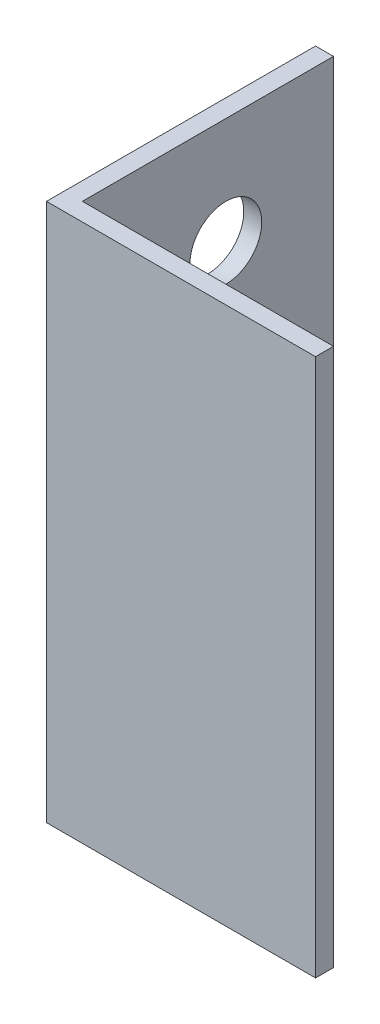
ISO-10303-21;
HEADER;
FILE_DESCRIPTION(('STEP AP214'),'2;1');
FILE_NAME('part.step','',(''),(''),'','','');
FILE_SCHEMA(('AUTOMOTIVE_DESIGN { 1 0 10303 214 1 1 1 1 }'));
ENDSEC;
DATA;
#1=APPLICATION_CONTEXT('core data for automotive mechanical design processes');
#2=APPLICATION_PROTOCOL_DEFINITION('international standard','automotive_design',2000,#1);
#3=PRODUCT_CONTEXT('',#1,'mechanical');
#4=PRODUCT('Part','Part','',(#3));
#5=PRODUCT_RELATED_PRODUCT_CATEGORY('part','',(#4));
#6=PRODUCT_DEFINITION_FORMATION('','',#4);
#7=PRODUCT_DEFINITION_CONTEXT('part definition',#1,'design');
#8=PRODUCT_DEFINITION('design','',#6,#7);
#9=PRODUCT_DEFINITION_SHAPE('','',#8);
#10=(LENGTH_UNIT() NAMED_UNIT(*) SI_UNIT(.MILLI.,.METRE.));
#11=(NAMED_UNIT(*) PLANE_ANGLE_UNIT() SI_UNIT($,.RADIAN.));
#12=(NAMED_UNIT(*) SI_UNIT($,.STERADIAN.) SOLID_ANGLE_UNIT());
#13=UNCERTAINTY_MEASURE_WITH_UNIT(LENGTH_MEASURE(1.E-05),#10,'distance_accuracy_value','');
#14=(GEOMETRIC_REPRESENTATION_CONTEXT(3) GLOBAL_UNCERTAINTY_ASSIGNED_CONTEXT((#13)) GLOBAL_UNIT_ASSIGNED_CONTEXT((#10,
#11,#12)) REPRESENTATION_CONTEXT('',''));
#15=CARTESIAN_POINT('',(0.,0.,0.));
#16=DIRECTION('',(0.,0.,1.));
#17=DIRECTION('',(1.,0.,0.));
#18=AXIS2_PLACEMENT_3D('',#15,#16,#17);
#19=CARTESIAN_POINT('',(0.,150.,0.));
#20=DIRECTION('',(0.,0.,-1.));
#21=DIRECTION('',(-1.,0.,0.));
#22=AXIS2_PLACEMENT_3D('',#19,#20,#21);
#23=PLANE('',#22);
#24=DIRECTION('',(1.,0.,0.));
#25=VECTOR('',#24,1.);
#26=CARTESIAN_POINT('',(0.,0.,0.));
#27=LINE('',#26,#25);
#28=CARTESIAN_POINT('',(0.,0.,0.));
#29=VERTEX_POINT('',#28);
#30=CARTESIAN_POINT('',(75.,0.,0.));
#31=VERTEX_POINT('',#30);
#32=EDGE_CURVE('E118',#29,#31,#27,.T.);
#33=ORIENTED_EDGE('',*,*,#32,.T.);
#34=DIRECTION('',(0.,-1.,0.));
#35=VECTOR('',#34,1.);
#36=CARTESIAN_POINT('',(75.,150.,0.));
#37=LINE('',#36,#35);
#38=CARTESIAN_POINT('',(75.,150.,0.));
#39=VERTEX_POINT('',#38);
#40=EDGE_CURVE('E11',#39,#31,#37,.T.);
#41=ORIENTED_EDGE('',*,*,#40,.F.);
#42=DIRECTION('',(1.,0.,0.));
#43=VECTOR('',#42,1.);
#44=CARTESIAN_POINT('',(0.,150.,0.));
#45=LINE('',#44,#43);
#46=CARTESIAN_POINT('',(0.,150.,0.));
#47=VERTEX_POINT('',#46);
#48=EDGE_CURVE('E83',#47,#39,#45,.T.);
#49=ORIENTED_EDGE('',*,*,#48,.F.);
#50=DIRECTION('',(0.,-1.,0.));
#51=VECTOR('',#50,1.);
#52=CARTESIAN_POINT('',(0.,150.,0.));
#53=LINE('',#52,#51);
#54=EDGE_CURVE('E114',#47,#29,#53,.T.);
#55=ORIENTED_EDGE('',*,*,#54,.T.);
#56=EDGE_LOOP('',(#33,#41,#49,#55));
#57=FACE_BOUND('',#56,.T.);
#58=ADVANCED_FACE('F37',(#57),#23,.F.);
#59=CARTESIAN_POINT('',(75.,150.,-5.));
#60=DIRECTION('',(1.,0.,0.));
#61=DIRECTION('',(0.,0.,-1.));
#62=AXIS2_PLACEMENT_3D('',#59,#60,#61);
#63=PLANE('',#62);
#64=DIRECTION('',(0.,0.,1.));
#65=VECTOR('',#64,1.);
#66=CARTESIAN_POINT('',(75.,0.,-5.));
#67=LINE('',#66,#65);
#68=CARTESIAN_POINT('',(75.,0.,-5.));
#69=VERTEX_POINT('',#68);
#70=EDGE_CURVE('E121',#69,#31,#67,.T.);
#71=ORIENTED_EDGE('',*,*,#70,.F.);
#72=DIRECTION('',(0.,-1.,0.));
#73=VECTOR('',#72,1.);
#74=CARTESIAN_POINT('',(75.,150.,-5.));
#75=LINE('',#74,#73);
#76=CARTESIAN_POINT('',(75.,150.,-5.));
#77=VERTEX_POINT('',#76);
#78=EDGE_CURVE('E45',#77,#69,#75,.T.);
#79=ORIENTED_EDGE('',*,*,#78,.F.);
#80=DIRECTION('',(0.,0.,1.));
#81=VECTOR('',#80,1.);
#82=CARTESIAN_POINT('',(75.,150.,-5.));
#83=LINE('',#82,#81);
#84=EDGE_CURVE('E181',#77,#39,#83,.T.);
#85=ORIENTED_EDGE('',*,*,#84,.T.);
#86=ORIENTED_EDGE('',*,*,#40,.T.);
#87=EDGE_LOOP('',(#71,#79,#85,#86));
#88=FACE_BOUND('',#87,.T.);
#89=ADVANCED_FACE('F140',(#88),#63,.T.);
#90=CARTESIAN_POINT('',(0.,150.,-5.));
#91=DIRECTION('',(0.,0.,-1.));
#92=DIRECTION('',(-1.,0.,0.));
#93=AXIS2_PLACEMENT_3D('',#90,#91,#92);
#94=PLANE('',#93);
#95=DIRECTION('',(1.,0.,0.));
#96=VECTOR('',#95,1.);
#97=CARTESIAN_POINT('',(0.,0.,-5.));
#98=LINE('',#97,#96);
#99=CARTESIAN_POINT('',(5.,0.,-5.));
#100=VERTEX_POINT('',#99);
#101=EDGE_CURVE('E125',#100,#69,#98,.T.);
#102=ORIENTED_EDGE('',*,*,#101,.F.);
#103=DIRECTION('',(0.,-1.,0.));
#104=VECTOR('',#103,1.);
#105=CARTESIAN_POINT('',(5.,150.,-5.));
#106=LINE('',#105,#104);
#107=CARTESIAN_POINT('',(5.,150.,-5.));
#108=VERTEX_POINT('',#107);
#109=EDGE_CURVE('E104',#108,#100,#106,.T.);
#110=ORIENTED_EDGE('',*,*,#109,.F.);
#111=DIRECTION('',(1.,0.,0.));
#112=VECTOR('',#111,1.);
#113=CARTESIAN_POINT('',(0.,150.,-5.));
#114=LINE('',#113,#112);
#115=EDGE_CURVE('E110',#108,#77,#114,.T.);
#116=ORIENTED_EDGE('',*,*,#115,.T.);
#117=ORIENTED_EDGE('',*,*,#78,.T.);
#118=EDGE_LOOP('',(#102,#110,#116,#117));
#119=FACE_BOUND('',#118,.T.);
#120=ADVANCED_FACE('F137',(#119),#94,.T.);
#121=CARTESIAN_POINT('',(4.99999999999999,150.,-75.));
#122=DIRECTION('',(1.,0.,0.));
#123=DIRECTION('',(0.,0.,-1.));
#124=AXIS2_PLACEMENT_3D('',#121,#122,#123);
#125=PLANE('',#124);
#126=CARTESIAN_POINT('',(4.99999999999999,120.,-45.));
#127=DIRECTION('',(1.,0.,0.));
#128=DIRECTION('',(0.,0.,-1.));
#129=AXIS2_PLACEMENT_3D('',#126,#127,#128);
#130=CIRCLE('',#129,10.);
#131=CARTESIAN_POINT('',(4.99999999999999,120.,-55.));
#132=VERTEX_POINT('',#131);
#133=EDGE_CURVE('E122',#132,#132,#130,.T.);
#134=ORIENTED_EDGE('',*,*,#133,.F.);
#135=EDGE_LOOP('',(#134));
#136=FACE_BOUND('',#135,.T.);
#137=DIRECTION('',(0.,0.,1.));
#138=VECTOR('',#137,1.);
#139=CARTESIAN_POINT('',(4.99999999999999,0.,-75.));
#140=LINE('',#139,#138);
#141=CARTESIAN_POINT('',(4.99999999999999,0.,-75.));
#142=VERTEX_POINT('',#141);
#143=EDGE_CURVE('E99',#142,#100,#140,.T.);
#144=ORIENTED_EDGE('',*,*,#143,.F.);
#145=DIRECTION('',(0.,-1.,0.));
#146=VECTOR('',#145,1.);
#147=CARTESIAN_POINT('',(4.99999999999999,150.,-75.));
#148=LINE('',#147,#146);
#149=CARTESIAN_POINT('',(4.99999999999999,150.,-75.));
#150=VERTEX_POINT('',#149);
#151=EDGE_CURVE('E94',#150,#142,#148,.T.);
#152=ORIENTED_EDGE('',*,*,#151,.F.);
#153=DIRECTION('',(0.,0.,1.));
#154=VECTOR('',#153,1.);
#155=CARTESIAN_POINT('',(4.99999999999999,150.,-75.));
#156=LINE('',#155,#154);
#157=EDGE_CURVE('E97',#150,#108,#156,.T.);
#158=ORIENTED_EDGE('',*,*,#157,.T.);
#159=ORIENTED_EDGE('',*,*,#109,.T.);
#160=EDGE_LOOP('',(#144,#152,#158,#159));
#161=FACE_BOUND('',#160,.T.);
#162=ADVANCED_FACE('F96',(#136,#161),#125,.T.);
#163=CARTESIAN_POINT('',(0.,150.,-75.));
#164=DIRECTION('',(0.,0.,-1.));
#165=DIRECTION('',(-1.,0.,0.));
#166=AXIS2_PLACEMENT_3D('',#163,#164,#165);
#167=PLANE('',#166);
#168=DIRECTION('',(1.,0.,0.));
#169=VECTOR('',#168,1.);
#170=CARTESIAN_POINT('',(0.,0.,-75.));
#171=LINE('',#170,#169);
#172=CARTESIAN_POINT('',(0.,0.,-75.));
#173=VERTEX_POINT('',#172);
#174=EDGE_CURVE('E129',#173,#142,#171,.T.);
#175=ORIENTED_EDGE('',*,*,#174,.F.);
#176=DIRECTION('',(0.,-1.,0.));
#177=VECTOR('',#176,1.);
#178=CARTESIAN_POINT('',(0.,150.,-75.));
#179=LINE('',#178,#177);
#180=CARTESIAN_POINT('',(0.,150.,-75.));
#181=VERTEX_POINT('',#180);
#182=EDGE_CURVE('E74',#181,#173,#179,.T.);
#183=ORIENTED_EDGE('',*,*,#182,.F.);
#184=DIRECTION('',(1.,0.,0.));
#185=VECTOR('',#184,1.);
#186=CARTESIAN_POINT('',(0.,150.,-75.));
#187=LINE('',#186,#185);
#188=EDGE_CURVE('E108',#181,#150,#187,.T.);
#189=ORIENTED_EDGE('',*,*,#188,.T.);
#190=ORIENTED_EDGE('',*,*,#151,.T.);
#191=EDGE_LOOP('',(#175,#183,#189,#190));
#192=FACE_BOUND('',#191,.T.);
#193=ADVANCED_FACE('F112',(#192),#167,.T.);
#194=CARTESIAN_POINT('',(0.,150.,-75.));
#195=DIRECTION('',(1.,0.,0.));
#196=DIRECTION('',(0.,0.,-1.));
#197=AXIS2_PLACEMENT_3D('',#194,#195,#196);
#198=PLANE('',#197);
#199=CARTESIAN_POINT('',(0.,120.,-45.));
#200=DIRECTION('',(-1.,0.,0.));
#201=DIRECTION('',(0.,0.,1.));
#202=AXIS2_PLACEMENT_3D('',#199,#200,#201);
#203=CIRCLE('',#202,10.);
#204=CARTESIAN_POINT('',(0.,120.,-35.));
#205=VERTEX_POINT('',#204);
#206=EDGE_CURVE('E175',#205,#205,#203,.T.);
#207=ORIENTED_EDGE('',*,*,#206,.F.);
#208=EDGE_LOOP('',(#207));
#209=FACE_BOUND('',#208,.T.);
#210=DIRECTION('',(0.,0.,1.));
#211=VECTOR('',#210,1.);
#212=CARTESIAN_POINT('',(0.,0.,-75.));
#213=LINE('',#212,#211);
#214=EDGE_CURVE('E77',#173,#29,#213,.T.);
#215=ORIENTED_EDGE('',*,*,#214,.T.);
#216=ORIENTED_EDGE('',*,*,#54,.F.);
#217=DIRECTION('',(0.,0.,1.));
#218=VECTOR('',#217,1.);
#219=CARTESIAN_POINT('',(0.,150.,-75.));
#220=LINE('',#219,#218);
#221=EDGE_CURVE('E53',#181,#47,#220,.T.);
#222=ORIENTED_EDGE('',*,*,#221,.F.);
#223=ORIENTED_EDGE('',*,*,#182,.T.);
#224=EDGE_LOOP('',(#215,#216,#222,#223));
#225=FACE_BOUND('',#224,.T.);
#226=ADVANCED_FACE('F145',(#209,#225),#198,.F.);
#227=CARTESIAN_POINT('',(0.,150.,0.));
#228=DIRECTION('',(0.,-1.,0.));
#229=DIRECTION('',(-1.,0.,0.));
#230=AXIS2_PLACEMENT_3D('',#227,#228,#229);
#231=PLANE('',#230);
#232=ORIENTED_EDGE('',*,*,#48,.T.);
#233=ORIENTED_EDGE('',*,*,#84,.F.);
#234=ORIENTED_EDGE('',*,*,#115,.F.);
#235=ORIENTED_EDGE('',*,*,#157,.F.);
#236=ORIENTED_EDGE('',*,*,#188,.F.);
#237=ORIENTED_EDGE('',*,*,#221,.T.);
#238=EDGE_LOOP('',(#232,#233,#234,#235,#236,#237));
#239=FACE_BOUND('',#238,.T.);
#240=ADVANCED_FACE('F107',(#239),#231,.F.);
#241=CARTESIAN_POINT('',(0.,0.,0.));
#242=DIRECTION('',(0.,-1.,0.));
#243=DIRECTION('',(-1.,0.,0.));
#244=AXIS2_PLACEMENT_3D('',#241,#242,#243);
#245=PLANE('',#244);
#246=ORIENTED_EDGE('',*,*,#32,.F.);
#247=ORIENTED_EDGE('',*,*,#214,.F.);
#248=ORIENTED_EDGE('',*,*,#174,.T.);
#249=ORIENTED_EDGE('',*,*,#143,.T.);
#250=ORIENTED_EDGE('',*,*,#101,.T.);
#251=ORIENTED_EDGE('',*,*,#70,.T.);
#252=EDGE_LOOP('',(#246,#247,#248,#249,#250,#251));
#253=FACE_BOUND('',#252,.T.);
#254=ADVANCED_FACE('F143',(#253),#245,.T.);
#255=CARTESIAN_POINT('',(75.,120.,-45.));
#256=DIRECTION('',(-1.,0.,0.));
#257=DIRECTION('',(0.,0.,1.));
#258=AXIS2_PLACEMENT_3D('',#255,#256,#257);
#259=CYLINDRICAL_SURFACE('',#258,10.);
#260=ORIENTED_EDGE('',*,*,#133,.T.);
#261=EDGE_LOOP('',(#260));
#262=FACE_BOUND('',#261,.T.);
#263=ORIENTED_EDGE('',*,*,#206,.T.);
#264=EDGE_LOOP('',(#263));
#265=FACE_BOUND('',#264,.T.);
#266=ADVANCED_FACE('F183',(#262,#265),#259,.F.);
#267=CLOSED_SHELL('',(#58,#89,#120,#162,#193,#226,#240,#254,#266));
#268=MANIFOLD_SOLID_BREP('B2',#267);
#269=ADVANCED_BREP_SHAPE_REPRESENTATION('',(#18,#268),#14);
#270=SHAPE_DEFINITION_REPRESENTATION(#9,#269);
ENDSEC;
END-ISO-10303-21;
